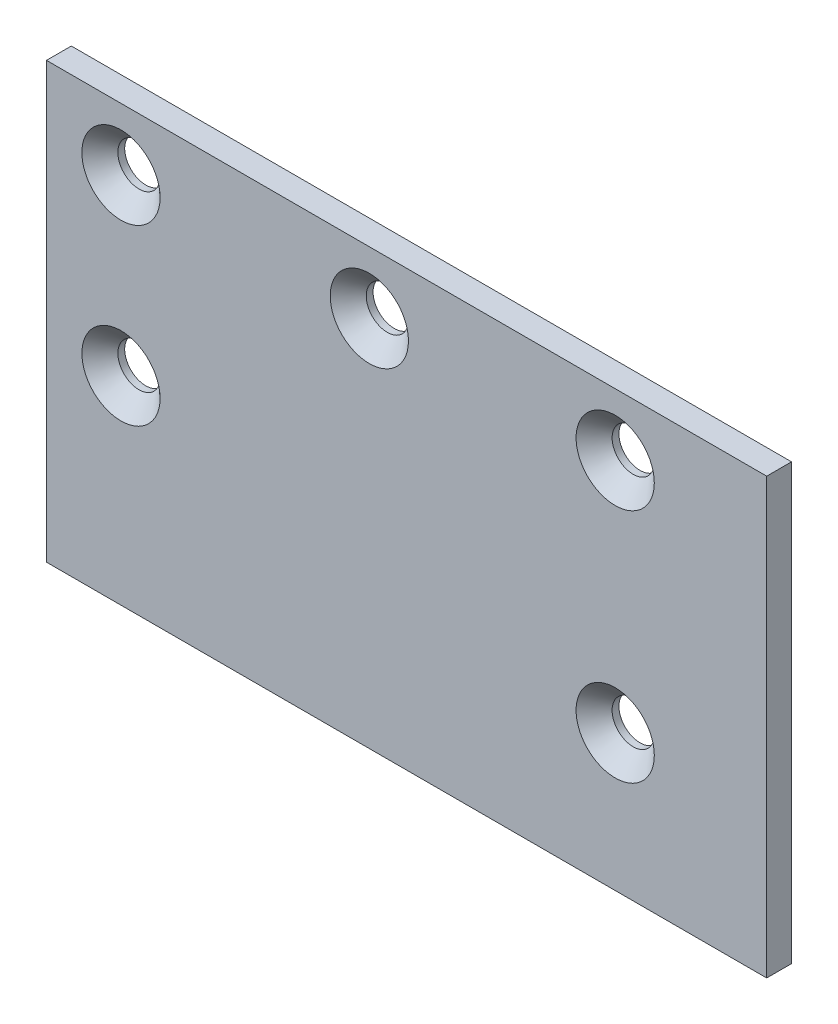
ISO-10303-21;
HEADER;
FILE_DESCRIPTION(('STEP AP214'),'2;1');
FILE_NAME('part.step','',(''),(''),'','','');
FILE_SCHEMA(('AUTOMOTIVE_DESIGN { 1 0 10303 214 1 1 1 1 }'));
ENDSEC;
DATA;
#1=APPLICATION_CONTEXT('core data for automotive mechanical design processes');
#2=APPLICATION_PROTOCOL_DEFINITION('international standard','automotive_design',2000,#1);
#3=PRODUCT_CONTEXT('',#1,'mechanical');
#4=PRODUCT('Part','Part','',(#3));
#5=PRODUCT_RELATED_PRODUCT_CATEGORY('part','',(#4));
#6=PRODUCT_DEFINITION_FORMATION('','',#4);
#7=PRODUCT_DEFINITION_CONTEXT('part definition',#1,'design');
#8=PRODUCT_DEFINITION('design','',#6,#7);
#9=PRODUCT_DEFINITION_SHAPE('','',#8);
#10=(LENGTH_UNIT() NAMED_UNIT(*) SI_UNIT(.MILLI.,.METRE.));
#11=(NAMED_UNIT(*) PLANE_ANGLE_UNIT() SI_UNIT($,.RADIAN.));
#12=(NAMED_UNIT(*) SI_UNIT($,.STERADIAN.) SOLID_ANGLE_UNIT());
#13=UNCERTAINTY_MEASURE_WITH_UNIT(LENGTH_MEASURE(1.E-05),#10,'distance_accuracy_value','');
#14=(GEOMETRIC_REPRESENTATION_CONTEXT(3) GLOBAL_UNCERTAINTY_ASSIGNED_CONTEXT((#13)) GLOBAL_UNIT_ASSIGNED_CONTEXT((#10,
#11,#12)) REPRESENTATION_CONTEXT('',''));
#15=CARTESIAN_POINT('',(0.,0.,0.));
#16=DIRECTION('',(0.,0.,1.));
#17=DIRECTION('',(1.,0.,0.));
#18=AXIS2_PLACEMENT_3D('',#15,#16,#17);
#19=CARTESIAN_POINT('',(29.,17.5,2.));
#20=DIRECTION('',(-1.,0.,0.));
#21=DIRECTION('',(0.,-1.,0.));
#22=AXIS2_PLACEMENT_3D('',#19,#20,#21);
#23=PLANE('',#22);
#24=DIRECTION('',(0.,1.,0.));
#25=VECTOR('',#24,1.);
#26=CARTESIAN_POINT('',(29.,17.5,0.));
#27=LINE('',#26,#25);
#28=CARTESIAN_POINT('',(29.,-17.5,0.));
#29=VERTEX_POINT('',#28);
#30=CARTESIAN_POINT('',(29.,17.5,0.));
#31=VERTEX_POINT('',#30);
#32=EDGE_CURVE('E113',#29,#31,#27,.T.);
#33=ORIENTED_EDGE('',*,*,#32,.T.);
#34=DIRECTION('',(0.,0.,-1.));
#35=VECTOR('',#34,1.);
#36=CARTESIAN_POINT('',(29.,17.5,2.));
#37=LINE('',#36,#35);
#38=CARTESIAN_POINT('',(29.,17.5,2.));
#39=VERTEX_POINT('',#38);
#40=EDGE_CURVE('E11',#39,#31,#37,.T.);
#41=ORIENTED_EDGE('',*,*,#40,.F.);
#42=DIRECTION('',(0.,1.,0.));
#43=VECTOR('',#42,1.);
#44=CARTESIAN_POINT('',(29.,17.5,2.));
#45=LINE('',#44,#43);
#46=CARTESIAN_POINT('',(29.,-17.5,2.));
#47=VERTEX_POINT('',#46);
#48=EDGE_CURVE('E97',#47,#39,#45,.T.);
#49=ORIENTED_EDGE('',*,*,#48,.F.);
#50=DIRECTION('',(0.,0.,-1.));
#51=VECTOR('',#50,1.);
#52=CARTESIAN_POINT('',(29.,-17.5,2.));
#53=LINE('',#52,#51);
#54=EDGE_CURVE('E109',#47,#29,#53,.T.);
#55=ORIENTED_EDGE('',*,*,#54,.T.);
#56=EDGE_LOOP('',(#33,#41,#49,#55));
#57=FACE_BOUND('',#56,.T.);
#58=ADVANCED_FACE('F45',(#57),#23,.F.);
#59=CARTESIAN_POINT('',(-29.,17.5,2.));
#60=DIRECTION('',(0.,-1.,0.));
#61=DIRECTION('',(0.,0.,-1.));
#62=AXIS2_PLACEMENT_3D('',#59,#60,#61);
#63=PLANE('',#62);
#64=DIRECTION('',(-1.,0.,0.));
#65=VECTOR('',#64,1.);
#66=CARTESIAN_POINT('',(-29.,17.5,0.));
#67=LINE('',#66,#65);
#68=CARTESIAN_POINT('',(-29.,17.5,0.));
#69=VERTEX_POINT('',#68);
#70=EDGE_CURVE('E102',#31,#69,#67,.T.);
#71=ORIENTED_EDGE('',*,*,#70,.T.);
#72=DIRECTION('',(0.,0.,-1.));
#73=VECTOR('',#72,1.);
#74=CARTESIAN_POINT('',(-29.,17.5,2.));
#75=LINE('',#74,#73);
#76=CARTESIAN_POINT('',(-29.,17.5,2.));
#77=VERTEX_POINT('',#76);
#78=EDGE_CURVE('E54',#77,#69,#75,.T.);
#79=ORIENTED_EDGE('',*,*,#78,.F.);
#80=DIRECTION('',(-1.,0.,0.));
#81=VECTOR('',#80,1.);
#82=CARTESIAN_POINT('',(-29.,17.5,2.));
#83=LINE('',#82,#81);
#84=EDGE_CURVE('E92',#39,#77,#83,.T.);
#85=ORIENTED_EDGE('',*,*,#84,.F.);
#86=ORIENTED_EDGE('',*,*,#40,.T.);
#87=EDGE_LOOP('',(#71,#79,#85,#86));
#88=FACE_BOUND('',#87,.T.);
#89=ADVANCED_FACE('F101',(#88),#63,.F.);
#90=CARTESIAN_POINT('',(-29.,17.5,2.));
#91=DIRECTION('',(1.,0.,0.));
#92=DIRECTION('',(0.,1.,0.));
#93=AXIS2_PLACEMENT_3D('',#90,#91,#92);
#94=PLANE('',#93);
#95=DIRECTION('',(0.,-1.,0.));
#96=VECTOR('',#95,1.);
#97=CARTESIAN_POINT('',(-29.,17.5,0.));
#98=LINE('',#97,#96);
#99=CARTESIAN_POINT('',(-29.,-17.5,0.));
#100=VERTEX_POINT('',#99);
#101=EDGE_CURVE('E79',#69,#100,#98,.T.);
#102=ORIENTED_EDGE('',*,*,#101,.T.);
#103=DIRECTION('',(0.,0.,-1.));
#104=VECTOR('',#103,1.);
#105=CARTESIAN_POINT('',(-29.,-17.5,2.));
#106=LINE('',#105,#104);
#107=CARTESIAN_POINT('',(-29.,-17.5,2.));
#108=VERTEX_POINT('',#107);
#109=EDGE_CURVE('E104',#108,#100,#106,.T.);
#110=ORIENTED_EDGE('',*,*,#109,.F.);
#111=DIRECTION('',(0.,-1.,0.));
#112=VECTOR('',#111,1.);
#113=CARTESIAN_POINT('',(-29.,17.5,2.));
#114=LINE('',#113,#112);
#115=EDGE_CURVE('E95',#77,#108,#114,.T.);
#116=ORIENTED_EDGE('',*,*,#115,.F.);
#117=ORIENTED_EDGE('',*,*,#78,.T.);
#118=EDGE_LOOP('',(#102,#110,#116,#117));
#119=FACE_BOUND('',#118,.T.);
#120=ADVANCED_FACE('F105',(#119),#94,.F.);
#121=CARTESIAN_POINT('',(-29.,-17.5,2.));
#122=DIRECTION('',(0.,1.,0.));
#123=DIRECTION('',(0.,0.,1.));
#124=AXIS2_PLACEMENT_3D('',#121,#122,#123);
#125=PLANE('',#124);
#126=DIRECTION('',(1.,0.,0.));
#127=VECTOR('',#126,1.);
#128=CARTESIAN_POINT('',(-29.,-17.5,0.));
#129=LINE('',#128,#127);
#130=EDGE_CURVE('E85',#100,#29,#129,.T.);
#131=ORIENTED_EDGE('',*,*,#130,.T.);
#132=ORIENTED_EDGE('',*,*,#54,.F.);
#133=DIRECTION('',(1.,0.,0.));
#134=VECTOR('',#133,1.);
#135=CARTESIAN_POINT('',(-29.,-17.5,2.));
#136=LINE('',#135,#134);
#137=EDGE_CURVE('E62',#108,#47,#136,.T.);
#138=ORIENTED_EDGE('',*,*,#137,.F.);
#139=ORIENTED_EDGE('',*,*,#109,.T.);
#140=EDGE_LOOP('',(#131,#132,#138,#139));
#141=FACE_BOUND('',#140,.T.);
#142=ADVANCED_FACE('F127',(#141),#125,.F.);
#143=CARTESIAN_POINT('',(0.,0.,2.));
#144=DIRECTION('',(0.,0.,1.));
#145=DIRECTION('',(1.,0.,0.));
#146=AXIS2_PLACEMENT_3D('',#143,#144,#145);
#147=PLANE('',#146);
#148=CARTESIAN_POINT('',(-23.,12.5,2.));
#149=DIRECTION('',(0.,0.,1.));
#150=DIRECTION('',(1.,0.,0.));
#151=AXIS2_PLACEMENT_3D('',#148,#149,#150);
#152=CIRCLE('',#151,3.15);
#153=CARTESIAN_POINT('',(-19.85,12.5,2.));
#154=VERTEX_POINT('',#153);
#155=EDGE_CURVE('E189',#154,#154,#152,.T.);
#156=ORIENTED_EDGE('',*,*,#155,.F.);
#157=EDGE_LOOP('',(#156));
#158=FACE_BOUND('',#157,.T.);
#159=CARTESIAN_POINT('',(-3.,12.5,2.));
#160=DIRECTION('',(0.,0.,1.));
#161=DIRECTION('',(1.,0.,0.));
#162=AXIS2_PLACEMENT_3D('',#159,#160,#161);
#163=CIRCLE('',#162,3.15);
#164=CARTESIAN_POINT('',(0.150000000000001,12.5,2.));
#165=VERTEX_POINT('',#164);
#166=EDGE_CURVE('E177',#165,#165,#163,.T.);
#167=ORIENTED_EDGE('',*,*,#166,.F.);
#168=EDGE_LOOP('',(#167));
#169=FACE_BOUND('',#168,.T.);
#170=CARTESIAN_POINT('',(16.8,12.5,2.));
#171=DIRECTION('',(0.,0.,1.));
#172=DIRECTION('',(1.,0.,0.));
#173=AXIS2_PLACEMENT_3D('',#170,#171,#172);
#174=CIRCLE('',#173,3.15);
#175=CARTESIAN_POINT('',(19.95,12.5,2.));
#176=VERTEX_POINT('',#175);
#177=EDGE_CURVE('E165',#176,#176,#174,.T.);
#178=ORIENTED_EDGE('',*,*,#177,.F.);
#179=EDGE_LOOP('',(#178));
#180=FACE_BOUND('',#179,.T.);
#181=CARTESIAN_POINT('',(16.8,-6.50000000000001,2.));
#182=DIRECTION('',(0.,0.,1.));
#183=DIRECTION('',(1.,0.,0.));
#184=AXIS2_PLACEMENT_3D('',#181,#182,#183);
#185=CIRCLE('',#184,3.15);
#186=CARTESIAN_POINT('',(19.95,-6.50000000000001,2.));
#187=VERTEX_POINT('',#186);
#188=EDGE_CURVE('E153',#187,#187,#185,.T.);
#189=ORIENTED_EDGE('',*,*,#188,.F.);
#190=EDGE_LOOP('',(#189));
#191=FACE_BOUND('',#190,.T.);
#192=CARTESIAN_POINT('',(-23.,-1.5,2.));
#193=DIRECTION('',(0.,0.,1.));
#194=DIRECTION('',(1.,0.,0.));
#195=AXIS2_PLACEMENT_3D('',#192,#193,#194);
#196=CIRCLE('',#195,3.15);
#197=CARTESIAN_POINT('',(-19.85,-1.5,2.));
#198=VERTEX_POINT('',#197);
#199=EDGE_CURVE('E141',#198,#198,#196,.T.);
#200=ORIENTED_EDGE('',*,*,#199,.F.);
#201=EDGE_LOOP('',(#200));
#202=FACE_BOUND('',#201,.T.);
#203=ORIENTED_EDGE('',*,*,#48,.T.);
#204=ORIENTED_EDGE('',*,*,#84,.T.);
#205=ORIENTED_EDGE('',*,*,#115,.T.);
#206=ORIENTED_EDGE('',*,*,#137,.T.);
#207=EDGE_LOOP('',(#203,#204,#205,#206));
#208=FACE_BOUND('',#207,.T.);
#209=ADVANCED_FACE('F93',(#158,#169,#180,#191,#202,#208),#147,.T.);
#210=CARTESIAN_POINT('',(0.,0.,0.));
#211=DIRECTION('',(0.,0.,1.));
#212=DIRECTION('',(1.,0.,0.));
#213=AXIS2_PLACEMENT_3D('',#210,#211,#212);
#214=PLANE('',#213);
#215=CARTESIAN_POINT('',(-23.,12.5,0.));
#216=DIRECTION('',(0.,0.,1.));
#217=DIRECTION('',(1.,0.,0.));
#218=AXIS2_PLACEMENT_3D('',#215,#216,#217);
#219=CIRCLE('',#218,1.7);
#220=CARTESIAN_POINT('',(-21.3,12.5,0.));
#221=VERTEX_POINT('',#220);
#222=EDGE_CURVE('E181',#221,#221,#219,.T.);
#223=ORIENTED_EDGE('',*,*,#222,.T.);
#224=EDGE_LOOP('',(#223));
#225=FACE_BOUND('',#224,.T.);
#226=CARTESIAN_POINT('',(-3.,12.5,0.));
#227=DIRECTION('',(0.,0.,1.));
#228=DIRECTION('',(1.,0.,0.));
#229=AXIS2_PLACEMENT_3D('',#226,#227,#228);
#230=CIRCLE('',#229,1.7);
#231=CARTESIAN_POINT('',(-1.3,12.5,0.));
#232=VERTEX_POINT('',#231);
#233=EDGE_CURVE('E169',#232,#232,#230,.T.);
#234=ORIENTED_EDGE('',*,*,#233,.T.);
#235=EDGE_LOOP('',(#234));
#236=FACE_BOUND('',#235,.T.);
#237=CARTESIAN_POINT('',(16.8,12.5,0.));
#238=DIRECTION('',(0.,0.,1.));
#239=DIRECTION('',(1.,0.,0.));
#240=AXIS2_PLACEMENT_3D('',#237,#238,#239);
#241=CIRCLE('',#240,1.7);
#242=CARTESIAN_POINT('',(18.5,12.5,0.));
#243=VERTEX_POINT('',#242);
#244=EDGE_CURVE('E157',#243,#243,#241,.T.);
#245=ORIENTED_EDGE('',*,*,#244,.T.);
#246=EDGE_LOOP('',(#245));
#247=FACE_BOUND('',#246,.T.);
#248=CARTESIAN_POINT('',(16.8,-6.50000000000001,0.));
#249=DIRECTION('',(0.,0.,1.));
#250=DIRECTION('',(1.,0.,0.));
#251=AXIS2_PLACEMENT_3D('',#248,#249,#250);
#252=CIRCLE('',#251,1.7);
#253=CARTESIAN_POINT('',(18.5,-6.50000000000001,0.));
#254=VERTEX_POINT('',#253);
#255=EDGE_CURVE('E145',#254,#254,#252,.T.);
#256=ORIENTED_EDGE('',*,*,#255,.T.);
#257=EDGE_LOOP('',(#256));
#258=FACE_BOUND('',#257,.T.);
#259=CARTESIAN_POINT('',(-23.,-1.5,0.));
#260=DIRECTION('',(0.,0.,1.));
#261=DIRECTION('',(1.,0.,0.));
#262=AXIS2_PLACEMENT_3D('',#259,#260,#261);
#263=CIRCLE('',#262,1.7);
#264=CARTESIAN_POINT('',(-21.3,-1.5,0.));
#265=VERTEX_POINT('',#264);
#266=EDGE_CURVE('E117',#265,#265,#263,.T.);
#267=ORIENTED_EDGE('',*,*,#266,.T.);
#268=EDGE_LOOP('',(#267));
#269=FACE_BOUND('',#268,.T.);
#270=ORIENTED_EDGE('',*,*,#32,.F.);
#271=ORIENTED_EDGE('',*,*,#130,.F.);
#272=ORIENTED_EDGE('',*,*,#101,.F.);
#273=ORIENTED_EDGE('',*,*,#70,.F.);
#274=EDGE_LOOP('',(#270,#271,#272,#273));
#275=FACE_BOUND('',#274,.T.);
#276=ADVANCED_FACE('F130',(#225,#236,#247,#258,#269,#275),#214,.F.);
#277=CARTESIAN_POINT('',(-23.,-1.5,2.));
#278=DIRECTION('',(0.,0.,1.));
#279=DIRECTION('',(1.,0.,0.));
#280=AXIS2_PLACEMENT_3D('',#277,#278,#279);
#281=CYLINDRICAL_SURFACE('',#280,1.7);
#282=ORIENTED_EDGE('',*,*,#266,.F.);
#283=EDGE_LOOP('',(#282));
#284=FACE_BOUND('',#283,.T.);
#285=CARTESIAN_POINT('',(-23.,-1.5,0.55));
#286=DIRECTION('',(0.,0.,1.));
#287=DIRECTION('',(1.,0.,0.));
#288=AXIS2_PLACEMENT_3D('',#285,#286,#287);
#289=CIRCLE('',#288,1.7);
#290=CARTESIAN_POINT('',(-21.3,-1.5,0.55));
#291=VERTEX_POINT('',#290);
#292=EDGE_CURVE('E137',#291,#291,#289,.T.);
#293=ORIENTED_EDGE('',*,*,#292,.T.);
#294=EDGE_LOOP('',(#293));
#295=FACE_BOUND('',#294,.T.);
#296=ADVANCED_FACE('F210',(#284,#295),#281,.F.);
#297=CARTESIAN_POINT('',(-23.,-1.5,2.));
#298=DIRECTION('',(0.,0.,1.));
#299=DIRECTION('',(1.,0.,0.));
#300=AXIS2_PLACEMENT_3D('',#297,#298,#299);
#301=CONICAL_SURFACE('',#300,3.15,0.785398163397448);
#302=ORIENTED_EDGE('',*,*,#292,.F.);
#303=EDGE_LOOP('',(#302));
#304=FACE_BOUND('',#303,.T.);
#305=ORIENTED_EDGE('',*,*,#199,.T.);
#306=EDGE_LOOP('',(#305));
#307=FACE_BOUND('',#306,.T.);
#308=ADVANCED_FACE('F207',(#304,#307),#301,.F.);
#309=CARTESIAN_POINT('',(16.8,-6.50000000000001,2.));
#310=DIRECTION('',(0.,0.,1.));
#311=DIRECTION('',(1.,0.,0.));
#312=AXIS2_PLACEMENT_3D('',#309,#310,#311);
#313=CYLINDRICAL_SURFACE('',#312,1.7);
#314=ORIENTED_EDGE('',*,*,#255,.F.);
#315=EDGE_LOOP('',(#314));
#316=FACE_BOUND('',#315,.T.);
#317=CARTESIAN_POINT('',(16.8,-6.50000000000001,0.55));
#318=DIRECTION('',(0.,0.,1.));
#319=DIRECTION('',(1.,0.,0.));
#320=AXIS2_PLACEMENT_3D('',#317,#318,#319);
#321=CIRCLE('',#320,1.7);
#322=CARTESIAN_POINT('',(18.5,-6.50000000000001,0.55));
#323=VERTEX_POINT('',#322);
#324=EDGE_CURVE('E149',#323,#323,#321,.T.);
#325=ORIENTED_EDGE('',*,*,#324,.T.);
#326=EDGE_LOOP('',(#325));
#327=FACE_BOUND('',#326,.T.);
#328=ADVANCED_FACE('F209',(#316,#327),#313,.F.);
#329=CARTESIAN_POINT('',(16.8,-6.50000000000001,2.));
#330=DIRECTION('',(0.,0.,1.));
#331=DIRECTION('',(1.,0.,0.));
#332=AXIS2_PLACEMENT_3D('',#329,#330,#331);
#333=CONICAL_SURFACE('',#332,3.15,0.785398163397448);
#334=ORIENTED_EDGE('',*,*,#324,.F.);
#335=EDGE_LOOP('',(#334));
#336=FACE_BOUND('',#335,.T.);
#337=ORIENTED_EDGE('',*,*,#188,.T.);
#338=EDGE_LOOP('',(#337));
#339=FACE_BOUND('',#338,.T.);
#340=ADVANCED_FACE('F217',(#336,#339),#333,.F.);
#341=CARTESIAN_POINT('',(16.8,12.5,2.));
#342=DIRECTION('',(0.,0.,1.));
#343=DIRECTION('',(1.,0.,0.));
#344=AXIS2_PLACEMENT_3D('',#341,#342,#343);
#345=CYLINDRICAL_SURFACE('',#344,1.7);
#346=ORIENTED_EDGE('',*,*,#244,.F.);
#347=EDGE_LOOP('',(#346));
#348=FACE_BOUND('',#347,.T.);
#349=CARTESIAN_POINT('',(16.8,12.5,0.55));
#350=DIRECTION('',(0.,0.,1.));
#351=DIRECTION('',(1.,0.,0.));
#352=AXIS2_PLACEMENT_3D('',#349,#350,#351);
#353=CIRCLE('',#352,1.7);
#354=CARTESIAN_POINT('',(18.5,12.5,0.55));
#355=VERTEX_POINT('',#354);
#356=EDGE_CURVE('E161',#355,#355,#353,.T.);
#357=ORIENTED_EDGE('',*,*,#356,.T.);
#358=EDGE_LOOP('',(#357));
#359=FACE_BOUND('',#358,.T.);
#360=ADVANCED_FACE('F253',(#348,#359),#345,.F.);
#361=CARTESIAN_POINT('',(16.8,12.5,2.));
#362=DIRECTION('',(0.,0.,1.));
#363=DIRECTION('',(1.,0.,0.));
#364=AXIS2_PLACEMENT_3D('',#361,#362,#363);
#365=CONICAL_SURFACE('',#364,3.15,0.785398163397448);
#366=ORIENTED_EDGE('',*,*,#356,.F.);
#367=EDGE_LOOP('',(#366));
#368=FACE_BOUND('',#367,.T.);
#369=ORIENTED_EDGE('',*,*,#177,.T.);
#370=EDGE_LOOP('',(#369));
#371=FACE_BOUND('',#370,.T.);
#372=ADVANCED_FACE('F258',(#368,#371),#365,.F.);
#373=CARTESIAN_POINT('',(-3.,12.5,2.));
#374=DIRECTION('',(0.,0.,1.));
#375=DIRECTION('',(1.,0.,0.));
#376=AXIS2_PLACEMENT_3D('',#373,#374,#375);
#377=CYLINDRICAL_SURFACE('',#376,1.7);
#378=ORIENTED_EDGE('',*,*,#233,.F.);
#379=EDGE_LOOP('',(#378));
#380=FACE_BOUND('',#379,.T.);
#381=CARTESIAN_POINT('',(-3.,12.5,0.55));
#382=DIRECTION('',(0.,0.,1.));
#383=DIRECTION('',(1.,0.,0.));
#384=AXIS2_PLACEMENT_3D('',#381,#382,#383);
#385=CIRCLE('',#384,1.7);
#386=CARTESIAN_POINT('',(-1.3,12.5,0.55));
#387=VERTEX_POINT('',#386);
#388=EDGE_CURVE('E173',#387,#387,#385,.T.);
#389=ORIENTED_EDGE('',*,*,#388,.T.);
#390=EDGE_LOOP('',(#389));
#391=FACE_BOUND('',#390,.T.);
#392=ADVANCED_FACE('F264',(#380,#391),#377,.F.);
#393=CARTESIAN_POINT('',(-3.,12.5,2.));
#394=DIRECTION('',(0.,0.,1.));
#395=DIRECTION('',(1.,0.,0.));
#396=AXIS2_PLACEMENT_3D('',#393,#394,#395);
#397=CONICAL_SURFACE('',#396,3.15,0.785398163397448);
#398=ORIENTED_EDGE('',*,*,#388,.F.);
#399=EDGE_LOOP('',(#398));
#400=FACE_BOUND('',#399,.T.);
#401=ORIENTED_EDGE('',*,*,#166,.T.);
#402=EDGE_LOOP('',(#401));
#403=FACE_BOUND('',#402,.T.);
#404=ADVANCED_FACE('F268',(#400,#403),#397,.F.);
#405=CARTESIAN_POINT('',(-23.,12.5,2.));
#406=DIRECTION('',(0.,0.,1.));
#407=DIRECTION('',(1.,0.,0.));
#408=AXIS2_PLACEMENT_3D('',#405,#406,#407);
#409=CYLINDRICAL_SURFACE('',#408,1.7);
#410=ORIENTED_EDGE('',*,*,#222,.F.);
#411=EDGE_LOOP('',(#410));
#412=FACE_BOUND('',#411,.T.);
#413=CARTESIAN_POINT('',(-23.,12.5,0.55));
#414=DIRECTION('',(0.,0.,1.));
#415=DIRECTION('',(1.,0.,0.));
#416=AXIS2_PLACEMENT_3D('',#413,#414,#415);
#417=CIRCLE('',#416,1.7);
#418=CARTESIAN_POINT('',(-21.3,12.5,0.55));
#419=VERTEX_POINT('',#418);
#420=EDGE_CURVE('E185',#419,#419,#417,.T.);
#421=ORIENTED_EDGE('',*,*,#420,.T.);
#422=EDGE_LOOP('',(#421));
#423=FACE_BOUND('',#422,.T.);
#424=ADVANCED_FACE('F272',(#412,#423),#409,.F.);
#425=CARTESIAN_POINT('',(-23.,12.5,2.));
#426=DIRECTION('',(0.,0.,1.));
#427=DIRECTION('',(1.,0.,0.));
#428=AXIS2_PLACEMENT_3D('',#425,#426,#427);
#429=CONICAL_SURFACE('',#428,3.15,0.785398163397448);
#430=ORIENTED_EDGE('',*,*,#420,.F.);
#431=EDGE_LOOP('',(#430));
#432=FACE_BOUND('',#431,.T.);
#433=ORIENTED_EDGE('',*,*,#155,.T.);
#434=EDGE_LOOP('',(#433));
#435=FACE_BOUND('',#434,.T.);
#436=ADVANCED_FACE('F194',(#432,#435),#429,.F.);
#437=CLOSED_SHELL('',(#58,#89,#120,#142,#209,#276,#296,#308,#328,#340,#360,#372,#392,#404,#424,#436));
#438=MANIFOLD_SOLID_BREP('B2',#437);
#439=ADVANCED_BREP_SHAPE_REPRESENTATION('',(#18,#438),#14);
#440=SHAPE_DEFINITION_REPRESENTATION(#9,#439);
ENDSEC;
END-ISO-10303-21;
